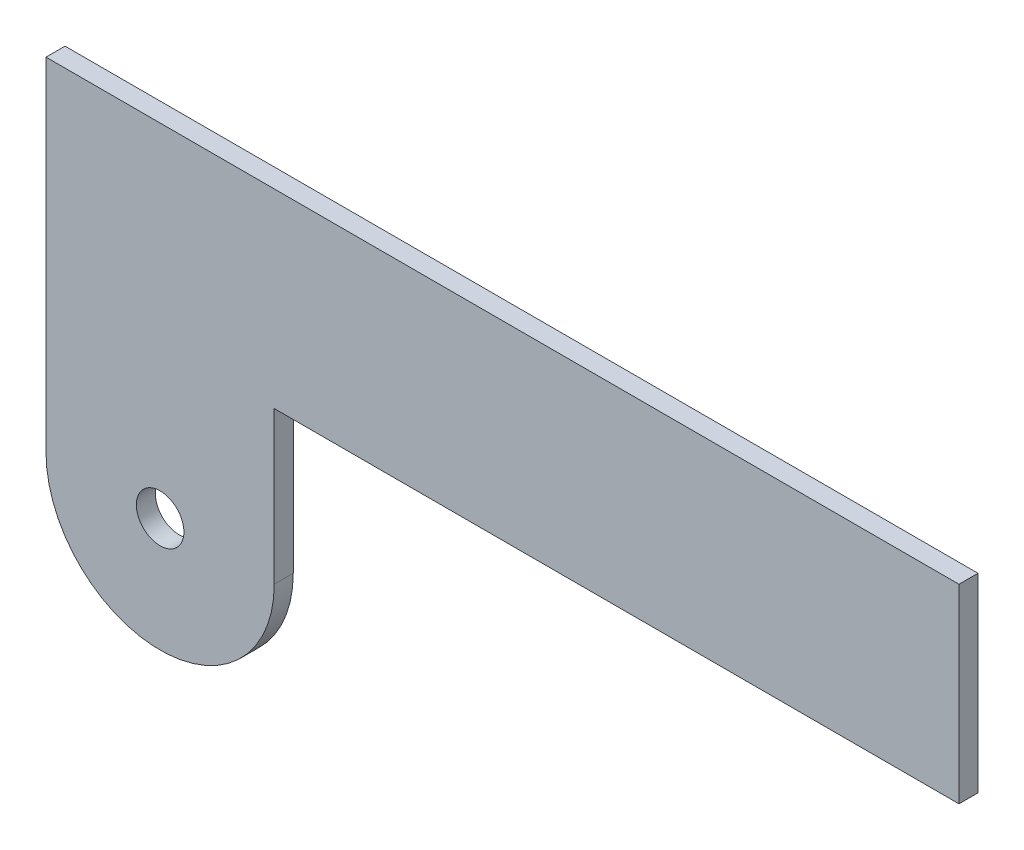
ISO-10303-21;
HEADER;
FILE_DESCRIPTION(('STEP AP214'),'2;1');
FILE_NAME('part.step','',(''),(''),'','','');
FILE_SCHEMA(('AUTOMOTIVE_DESIGN { 1 0 10303 214 1 1 1 1 }'));
ENDSEC;
DATA;
#1=APPLICATION_CONTEXT('core data for automotive mechanical design processes');
#2=APPLICATION_PROTOCOL_DEFINITION('international standard','automotive_design',2000,#1);
#3=PRODUCT_CONTEXT('',#1,'mechanical');
#4=PRODUCT('Part','Part','',(#3));
#5=PRODUCT_RELATED_PRODUCT_CATEGORY('part','',(#4));
#6=PRODUCT_DEFINITION_FORMATION('','',#4);
#7=PRODUCT_DEFINITION_CONTEXT('part definition',#1,'design');
#8=PRODUCT_DEFINITION('design','',#6,#7);
#9=PRODUCT_DEFINITION_SHAPE('','',#8);
#10=(LENGTH_UNIT() NAMED_UNIT(*) SI_UNIT(.MILLI.,.METRE.));
#11=(NAMED_UNIT(*) PLANE_ANGLE_UNIT() SI_UNIT($,.RADIAN.));
#12=(NAMED_UNIT(*) SI_UNIT($,.STERADIAN.) SOLID_ANGLE_UNIT());
#13=UNCERTAINTY_MEASURE_WITH_UNIT(LENGTH_MEASURE(1.E-05),#10,'distance_accuracy_value','');
#14=(GEOMETRIC_REPRESENTATION_CONTEXT(3) GLOBAL_UNCERTAINTY_ASSIGNED_CONTEXT((#13)) GLOBAL_UNIT_ASSIGNED_CONTEXT((#10,
#11,#12)) REPRESENTATION_CONTEXT('',''));
#15=CARTESIAN_POINT('',(0.,0.,0.));
#16=DIRECTION('',(0.,0.,1.));
#17=DIRECTION('',(1.,0.,0.));
#18=AXIS2_PLACEMENT_3D('',#15,#16,#17);
#19=CARTESIAN_POINT('',(0.,-164.568692458267,1.5875));
#20=DIRECTION('',(1.,0.,0.));
#21=DIRECTION('',(0.,0.,-1.));
#22=AXIS2_PLACEMENT_3D('',#19,#20,#21);
#23=PLANE('',#22);
#24=DIRECTION('',(0.,-1.,0.));
#25=VECTOR('',#24,1.);
#26=CARTESIAN_POINT('',(0.,-164.568692458267,-1.5875));
#27=LINE('',#26,#25);
#28=CARTESIAN_POINT('',(0.,0.,-1.5875));
#29=VERTEX_POINT('',#28);
#30=CARTESIAN_POINT('',(0.,-57.15,-1.5875));
#31=VERTEX_POINT('',#30);
#32=EDGE_CURVE('E122',#29,#31,#27,.T.);
#33=ORIENTED_EDGE('',*,*,#32,.T.);
#34=DIRECTION('',(0.,0.,-1.));
#35=VECTOR('',#34,1.);
#36=CARTESIAN_POINT('',(0.,-57.15,1.5875));
#37=LINE('',#36,#35);
#38=CARTESIAN_POINT('',(0.,-57.15,1.5875));
#39=VERTEX_POINT('',#38);
#40=EDGE_CURVE('E11',#39,#31,#37,.T.);
#41=ORIENTED_EDGE('',*,*,#40,.F.);
#42=DIRECTION('',(0.,-1.,0.));
#43=VECTOR('',#42,1.);
#44=CARTESIAN_POINT('',(0.,-164.568692458267,1.5875));
#45=LINE('',#44,#43);
#46=CARTESIAN_POINT('',(0.,0.,1.5875));
#47=VERTEX_POINT('',#46);
#48=EDGE_CURVE('E145',#47,#39,#45,.T.);
#49=ORIENTED_EDGE('',*,*,#48,.F.);
#50=DIRECTION('',(0.,0.,-1.));
#51=VECTOR('',#50,1.);
#52=CARTESIAN_POINT('',(0.,0.,1.5875));
#53=LINE('',#52,#51);
#54=EDGE_CURVE('E115',#47,#29,#53,.T.);
#55=ORIENTED_EDGE('',*,*,#54,.T.);
#56=EDGE_LOOP('',(#33,#41,#49,#55));
#57=FACE_BOUND('',#56,.T.);
#58=ADVANCED_FACE('F34',(#57),#23,.F.);
#59=CARTESIAN_POINT('',(19.05,-57.15,1.5875));
#60=DIRECTION('',(0.,0.,-1.));
#61=DIRECTION('',(-1.,0.,0.));
#62=AXIS2_PLACEMENT_3D('',#59,#60,#61);
#63=CYLINDRICAL_SURFACE('',#62,19.05);
#64=CARTESIAN_POINT('',(19.05,-57.15,-1.5875));
#65=DIRECTION('',(0.,0.,1.));
#66=DIRECTION('',(1.,0.,0.));
#67=AXIS2_PLACEMENT_3D('',#64,#65,#66);
#68=CIRCLE('',#67,19.05);
#69=CARTESIAN_POINT('',(38.1,-57.15,-1.5875));
#70=VERTEX_POINT('',#69);
#71=EDGE_CURVE('E125',#31,#70,#68,.T.);
#72=ORIENTED_EDGE('',*,*,#71,.T.);
#73=DIRECTION('',(0.,0.,-1.));
#74=VECTOR('',#73,1.);
#75=CARTESIAN_POINT('',(38.1,-57.15,1.5875));
#76=LINE('',#75,#74);
#77=CARTESIAN_POINT('',(38.1,-57.15,1.5875));
#78=VERTEX_POINT('',#77);
#79=EDGE_CURVE('E43',#78,#70,#76,.T.);
#80=ORIENTED_EDGE('',*,*,#79,.F.);
#81=CARTESIAN_POINT('',(19.05,-57.15,1.5875));
#82=DIRECTION('',(0.,0.,1.));
#83=DIRECTION('',(1.,0.,0.));
#84=AXIS2_PLACEMENT_3D('',#81,#82,#83);
#85=CIRCLE('',#84,19.05);
#86=EDGE_CURVE('E88',#39,#78,#85,.T.);
#87=ORIENTED_EDGE('',*,*,#86,.F.);
#88=ORIENTED_EDGE('',*,*,#40,.T.);
#89=EDGE_LOOP('',(#72,#80,#87,#88));
#90=FACE_BOUND('',#89,.T.);
#91=ADVANCED_FACE('F159',(#90),#63,.T.);
#92=CARTESIAN_POINT('',(38.1,-164.568692458267,1.5875));
#93=DIRECTION('',(-1.,0.,0.));
#94=DIRECTION('',(0.,0.,1.));
#95=AXIS2_PLACEMENT_3D('',#92,#93,#94);
#96=PLANE('',#95);
#97=DIRECTION('',(0.,1.,0.));
#98=VECTOR('',#97,1.);
#99=CARTESIAN_POINT('',(38.1,-164.568692458267,-1.5875));
#100=LINE('',#99,#98);
#101=CARTESIAN_POINT('',(38.1,-31.75,-1.5875));
#102=VERTEX_POINT('',#101);
#103=EDGE_CURVE('E127',#70,#102,#100,.T.);
#104=ORIENTED_EDGE('',*,*,#103,.T.);
#105=DIRECTION('',(0.,0.,-1.));
#106=VECTOR('',#105,1.);
#107=CARTESIAN_POINT('',(38.1,-31.75,1.5875));
#108=LINE('',#107,#106);
#109=CARTESIAN_POINT('',(38.1,-31.75,1.5875));
#110=VERTEX_POINT('',#109);
#111=EDGE_CURVE('E110',#110,#102,#108,.T.);
#112=ORIENTED_EDGE('',*,*,#111,.F.);
#113=DIRECTION('',(0.,1.,0.));
#114=VECTOR('',#113,1.);
#115=CARTESIAN_POINT('',(38.1,-164.568692458267,1.5875));
#116=LINE('',#115,#114);
#117=EDGE_CURVE('E101',#78,#110,#116,.T.);
#118=ORIENTED_EDGE('',*,*,#117,.F.);
#119=ORIENTED_EDGE('',*,*,#79,.T.);
#120=EDGE_LOOP('',(#104,#112,#118,#119));
#121=FACE_BOUND('',#120,.T.);
#122=ADVANCED_FACE('F138',(#121),#96,.F.);
#123=CARTESIAN_POINT('',(72.7621215879205,-31.75,1.5875));
#124=DIRECTION('',(0.,1.,0.));
#125=DIRECTION('',(0.,0.,1.));
#126=AXIS2_PLACEMENT_3D('',#123,#124,#125);
#127=PLANE('',#126);
#128=DIRECTION('',(1.,0.,0.));
#129=VECTOR('',#128,1.);
#130=CARTESIAN_POINT('',(72.7621215879205,-31.75,-1.5875));
#131=LINE('',#130,#129);
#132=CARTESIAN_POINT('',(152.4,-31.75,-1.5875));
#133=VERTEX_POINT('',#132);
#134=EDGE_CURVE('E109',#102,#133,#131,.T.);
#135=ORIENTED_EDGE('',*,*,#134,.T.);
#136=DIRECTION('',(0.,0.,-1.));
#137=VECTOR('',#136,1.);
#138=CARTESIAN_POINT('',(152.4,-31.75,1.5875));
#139=LINE('',#138,#137);
#140=CARTESIAN_POINT('',(152.4,-31.75,1.5875));
#141=VERTEX_POINT('',#140);
#142=EDGE_CURVE('E106',#141,#133,#139,.T.);
#143=ORIENTED_EDGE('',*,*,#142,.F.);
#144=DIRECTION('',(1.,0.,0.));
#145=VECTOR('',#144,1.);
#146=CARTESIAN_POINT('',(72.7621215879205,-31.75,1.5875));
#147=LINE('',#146,#145);
#148=EDGE_CURVE('E95',#110,#141,#147,.T.);
#149=ORIENTED_EDGE('',*,*,#148,.F.);
#150=ORIENTED_EDGE('',*,*,#111,.T.);
#151=EDGE_LOOP('',(#135,#143,#149,#150));
#152=FACE_BOUND('',#151,.T.);
#153=ADVANCED_FACE('F107',(#152),#127,.F.);
#154=CARTESIAN_POINT('',(152.4,-164.568692458267,1.5875));
#155=DIRECTION('',(-1.,0.,0.));
#156=DIRECTION('',(0.,0.,1.));
#157=AXIS2_PLACEMENT_3D('',#154,#155,#156);
#158=PLANE('',#157);
#159=DIRECTION('',(0.,1.,0.));
#160=VECTOR('',#159,1.);
#161=CARTESIAN_POINT('',(152.4,-164.568692458267,-1.5875));
#162=LINE('',#161,#160);
#163=CARTESIAN_POINT('',(152.4,0.,-1.5875));
#164=VERTEX_POINT('',#163);
#165=EDGE_CURVE('E74',#133,#164,#162,.T.);
#166=ORIENTED_EDGE('',*,*,#165,.T.);
#167=DIRECTION('',(0.,0.,-1.));
#168=VECTOR('',#167,1.);
#169=CARTESIAN_POINT('',(152.4,0.,1.5875));
#170=LINE('',#169,#168);
#171=CARTESIAN_POINT('',(152.4,0.,1.5875));
#172=VERTEX_POINT('',#171);
#173=EDGE_CURVE('E111',#172,#164,#170,.T.);
#174=ORIENTED_EDGE('',*,*,#173,.F.);
#175=DIRECTION('',(0.,1.,0.));
#176=VECTOR('',#175,1.);
#177=CARTESIAN_POINT('',(152.4,-164.568692458267,1.5875));
#178=LINE('',#177,#176);
#179=EDGE_CURVE('E99',#141,#172,#178,.T.);
#180=ORIENTED_EDGE('',*,*,#179,.F.);
#181=ORIENTED_EDGE('',*,*,#142,.T.);
#182=EDGE_LOOP('',(#166,#174,#180,#181));
#183=FACE_BOUND('',#182,.T.);
#184=ADVANCED_FACE('F113',(#183),#158,.F.);
#185=CARTESIAN_POINT('',(19.05,-57.15,1.5875));
#186=DIRECTION('',(0.,0.,-1.));
#187=DIRECTION('',(-1.,0.,0.));
#188=AXIS2_PLACEMENT_3D('',#185,#186,#187);
#189=CYLINDRICAL_SURFACE('',#188,3.96875);
#190=CARTESIAN_POINT('',(19.05,-57.15,1.5875));
#191=DIRECTION('',(0.,0.,1.));
#192=DIRECTION('',(1.,0.,0.));
#193=AXIS2_PLACEMENT_3D('',#190,#191,#192);
#194=CIRCLE('',#193,3.96875);
#195=CARTESIAN_POINT('',(23.01875,-57.15,1.5875));
#196=VERTEX_POINT('',#195);
#197=EDGE_CURVE('E132',#196,#196,#194,.T.);
#198=ORIENTED_EDGE('',*,*,#197,.T.);
#199=EDGE_LOOP('',(#198));
#200=FACE_BOUND('',#199,.T.);
#201=CARTESIAN_POINT('',(19.05,-57.15,-1.5875));
#202=DIRECTION('',(0.,0.,1.));
#203=DIRECTION('',(1.,0.,0.));
#204=AXIS2_PLACEMENT_3D('',#201,#202,#203);
#205=CIRCLE('',#204,3.96875);
#206=CARTESIAN_POINT('',(23.01875,-57.15,-1.5875));
#207=VERTEX_POINT('',#206);
#208=EDGE_CURVE('E119',#207,#207,#205,.T.);
#209=ORIENTED_EDGE('',*,*,#208,.F.);
#210=EDGE_LOOP('',(#209));
#211=FACE_BOUND('',#210,.T.);
#212=ADVANCED_FACE('F36',(#200,#211),#189,.F.);
#213=CARTESIAN_POINT('',(72.7621215879205,0.,1.5875));
#214=DIRECTION('',(0.,-1.,0.));
#215=DIRECTION('',(0.,0.,-1.));
#216=AXIS2_PLACEMENT_3D('',#213,#214,#215);
#217=PLANE('',#216);
#218=DIRECTION('',(-1.,0.,0.));
#219=VECTOR('',#218,1.);
#220=CARTESIAN_POINT('',(72.7621215879205,0.,-1.5875));
#221=LINE('',#220,#219);
#222=EDGE_CURVE('E80',#164,#29,#221,.T.);
#223=ORIENTED_EDGE('',*,*,#222,.T.);
#224=ORIENTED_EDGE('',*,*,#54,.F.);
#225=DIRECTION('',(-1.,0.,0.));
#226=VECTOR('',#225,1.);
#227=CARTESIAN_POINT('',(72.7621215879205,0.,1.5875));
#228=LINE('',#227,#226);
#229=EDGE_CURVE('E51',#172,#47,#228,.T.);
#230=ORIENTED_EDGE('',*,*,#229,.F.);
#231=ORIENTED_EDGE('',*,*,#173,.T.);
#232=EDGE_LOOP('',(#223,#224,#230,#231));
#233=FACE_BOUND('',#232,.T.);
#234=ADVANCED_FACE('F146',(#233),#217,.F.);
#235=CARTESIAN_POINT('',(72.7621215879205,-164.568692458267,1.5875));
#236=DIRECTION('',(0.,0.,1.));
#237=DIRECTION('',(1.,0.,0.));
#238=AXIS2_PLACEMENT_3D('',#235,#236,#237);
#239=PLANE('',#238);
#240=ORIENTED_EDGE('',*,*,#197,.F.);
#241=EDGE_LOOP('',(#240));
#242=FACE_BOUND('',#241,.T.);
#243=ORIENTED_EDGE('',*,*,#48,.T.);
#244=ORIENTED_EDGE('',*,*,#86,.T.);
#245=ORIENTED_EDGE('',*,*,#117,.T.);
#246=ORIENTED_EDGE('',*,*,#148,.T.);
#247=ORIENTED_EDGE('',*,*,#179,.T.);
#248=ORIENTED_EDGE('',*,*,#229,.T.);
#249=EDGE_LOOP('',(#243,#244,#245,#246,#247,#248));
#250=FACE_BOUND('',#249,.T.);
#251=ADVANCED_FACE('F97',(#242,#250),#239,.T.);
#252=CARTESIAN_POINT('',(72.7621215879205,-164.568692458267,-1.5875));
#253=DIRECTION('',(0.,0.,1.));
#254=DIRECTION('',(1.,0.,0.));
#255=AXIS2_PLACEMENT_3D('',#252,#253,#254);
#256=PLANE('',#255);
#257=ORIENTED_EDGE('',*,*,#208,.T.);
#258=EDGE_LOOP('',(#257));
#259=FACE_BOUND('',#258,.T.);
#260=ORIENTED_EDGE('',*,*,#32,.F.);
#261=ORIENTED_EDGE('',*,*,#222,.F.);
#262=ORIENTED_EDGE('',*,*,#165,.F.);
#263=ORIENTED_EDGE('',*,*,#134,.F.);
#264=ORIENTED_EDGE('',*,*,#103,.F.);
#265=ORIENTED_EDGE('',*,*,#71,.F.);
#266=EDGE_LOOP('',(#260,#261,#262,#263,#264,#265));
#267=FACE_BOUND('',#266,.T.);
#268=ADVANCED_FACE('F141',(#259,#267),#256,.F.);
#269=CLOSED_SHELL('',(#58,#91,#122,#153,#184,#212,#234,#251,#268));
#270=MANIFOLD_SOLID_BREP('B2',#269);
#271=ADVANCED_BREP_SHAPE_REPRESENTATION('',(#18,#270),#14);
#272=SHAPE_DEFINITION_REPRESENTATION(#9,#271);
ENDSEC;
END-ISO-10303-21;
